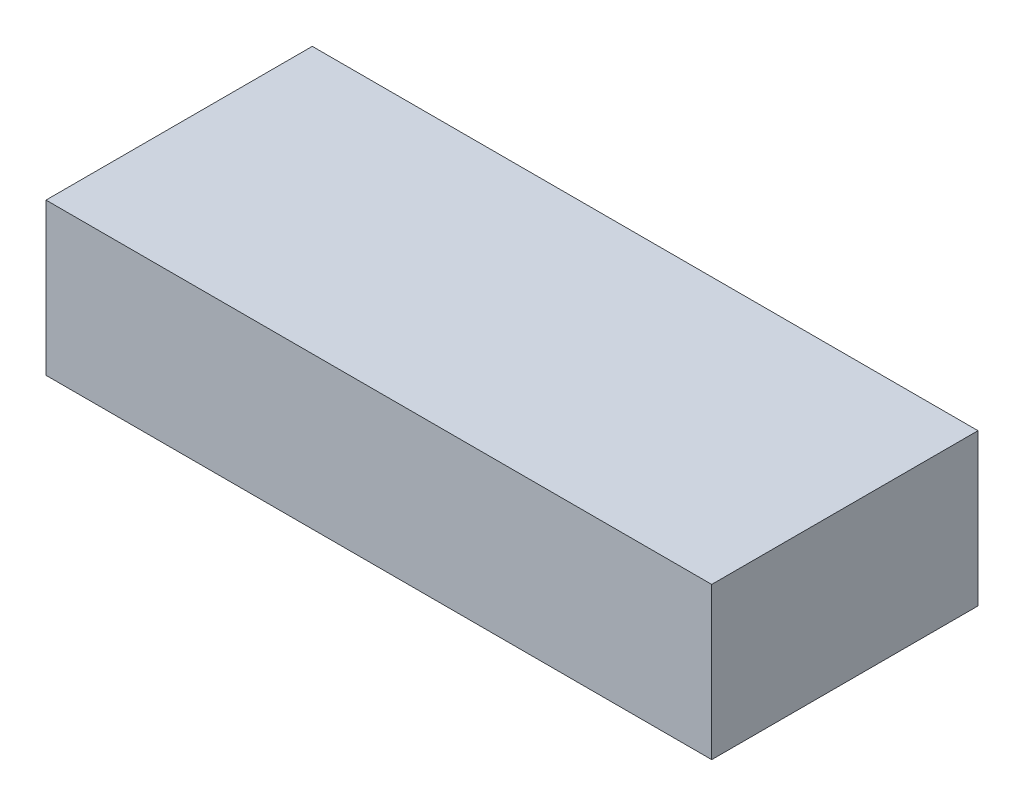
ISO-10303-21;
HEADER;
FILE_DESCRIPTION(('STEP AP214'),'2;1');
FILE_NAME('part.step','',(''),(''),'','','');
FILE_SCHEMA(('AUTOMOTIVE_DESIGN { 1 0 10303 214 1 1 1 1 }'));
ENDSEC;
DATA;
#1=APPLICATION_CONTEXT('core data for automotive mechanical design processes');
#2=APPLICATION_PROTOCOL_DEFINITION('international standard','automotive_design',2000,#1);
#3=PRODUCT_CONTEXT('',#1,'mechanical');
#4=PRODUCT('Part','Part','',(#3));
#5=PRODUCT_RELATED_PRODUCT_CATEGORY('part','',(#4));
#6=PRODUCT_DEFINITION_FORMATION('','',#4);
#7=PRODUCT_DEFINITION_CONTEXT('part definition',#1,'design');
#8=PRODUCT_DEFINITION('design','',#6,#7);
#9=PRODUCT_DEFINITION_SHAPE('','',#8);
#10=(LENGTH_UNIT() NAMED_UNIT(*) SI_UNIT(.MILLI.,.METRE.));
#11=(NAMED_UNIT(*) PLANE_ANGLE_UNIT() SI_UNIT($,.RADIAN.));
#12=(NAMED_UNIT(*) SI_UNIT($,.STERADIAN.) SOLID_ANGLE_UNIT());
#13=UNCERTAINTY_MEASURE_WITH_UNIT(LENGTH_MEASURE(1.E-05),#10,'distance_accuracy_value','');
#14=(GEOMETRIC_REPRESENTATION_CONTEXT(3) GLOBAL_UNCERTAINTY_ASSIGNED_CONTEXT((#13)) GLOBAL_UNIT_ASSIGNED_CONTEXT((#10,
#11,#12)) REPRESENTATION_CONTEXT('',''));
#15=CARTESIAN_POINT('',(0.,0.,0.));
#16=DIRECTION('',(0.,0.,1.));
#17=DIRECTION('',(1.,0.,0.));
#18=AXIS2_PLACEMENT_3D('',#15,#16,#17);
#19=CARTESIAN_POINT('',(12.5,5.7,-5.));
#20=DIRECTION('',(-1.,0.,0.));
#21=DIRECTION('',(0.,0.,1.));
#22=AXIS2_PLACEMENT_3D('',#19,#20,#21);
#23=PLANE('',#22);
#24=DIRECTION('',(0.,0.,-1.));
#25=VECTOR('',#24,1.);
#26=CARTESIAN_POINT('',(12.5,0.,-5.));
#27=LINE('',#26,#25);
#28=CARTESIAN_POINT('',(12.5,0.,5.));
#29=VERTEX_POINT('',#28);
#30=CARTESIAN_POINT('',(12.5,0.,-5.));
#31=VERTEX_POINT('',#30);
#32=EDGE_CURVE('E111',#29,#31,#27,.T.);
#33=ORIENTED_EDGE('',*,*,#32,.T.);
#34=DIRECTION('',(0.,-1.,0.));
#35=VECTOR('',#34,1.);
#36=CARTESIAN_POINT('',(12.5,5.7,-5.));
#37=LINE('',#36,#35);
#38=CARTESIAN_POINT('',(12.5,5.7,-5.));
#39=VERTEX_POINT('',#38);
#40=EDGE_CURVE('E11',#39,#31,#37,.T.);
#41=ORIENTED_EDGE('',*,*,#40,.F.);
#42=DIRECTION('',(0.,0.,-1.));
#43=VECTOR('',#42,1.);
#44=CARTESIAN_POINT('',(12.5,5.7,-5.));
#45=LINE('',#44,#43);
#46=CARTESIAN_POINT('',(12.5,5.7,5.));
#47=VERTEX_POINT('',#46);
#48=EDGE_CURVE('E95',#47,#39,#45,.T.);
#49=ORIENTED_EDGE('',*,*,#48,.F.);
#50=DIRECTION('',(0.,-1.,0.));
#51=VECTOR('',#50,1.);
#52=CARTESIAN_POINT('',(12.5,5.7,5.));
#53=LINE('',#52,#51);
#54=EDGE_CURVE('E107',#47,#29,#53,.T.);
#55=ORIENTED_EDGE('',*,*,#54,.T.);
#56=EDGE_LOOP('',(#33,#41,#49,#55));
#57=FACE_BOUND('',#56,.T.);
#58=ADVANCED_FACE('F43',(#57),#23,.F.);
#59=CARTESIAN_POINT('',(-12.5,5.7,-5.));
#60=DIRECTION('',(0.,0.,1.));
#61=DIRECTION('',(1.,0.,0.));
#62=AXIS2_PLACEMENT_3D('',#59,#60,#61);
#63=PLANE('',#62);
#64=DIRECTION('',(-1.,0.,0.));
#65=VECTOR('',#64,1.);
#66=CARTESIAN_POINT('',(-12.5,0.,-5.));
#67=LINE('',#66,#65);
#68=CARTESIAN_POINT('',(-12.5,0.,-5.));
#69=VERTEX_POINT('',#68);
#70=EDGE_CURVE('E100',#31,#69,#67,.T.);
#71=ORIENTED_EDGE('',*,*,#70,.T.);
#72=DIRECTION('',(0.,-1.,0.));
#73=VECTOR('',#72,1.);
#74=CARTESIAN_POINT('',(-12.5,5.7,-5.));
#75=LINE('',#74,#73);
#76=CARTESIAN_POINT('',(-12.5,5.7,-5.));
#77=VERTEX_POINT('',#76);
#78=EDGE_CURVE('E52',#77,#69,#75,.T.);
#79=ORIENTED_EDGE('',*,*,#78,.F.);
#80=DIRECTION('',(-1.,0.,0.));
#81=VECTOR('',#80,1.);
#82=CARTESIAN_POINT('',(-12.5,5.7,-5.));
#83=LINE('',#82,#81);
#84=EDGE_CURVE('E90',#39,#77,#83,.T.);
#85=ORIENTED_EDGE('',*,*,#84,.F.);
#86=ORIENTED_EDGE('',*,*,#40,.T.);
#87=EDGE_LOOP('',(#71,#79,#85,#86));
#88=FACE_BOUND('',#87,.T.);
#89=ADVANCED_FACE('F99',(#88),#63,.F.);
#90=CARTESIAN_POINT('',(-12.5,5.7,-5.));
#91=DIRECTION('',(1.,0.,0.));
#92=DIRECTION('',(0.,0.,-1.));
#93=AXIS2_PLACEMENT_3D('',#90,#91,#92);
#94=PLANE('',#93);
#95=DIRECTION('',(0.,0.,1.));
#96=VECTOR('',#95,1.);
#97=CARTESIAN_POINT('',(-12.5,0.,-5.));
#98=LINE('',#97,#96);
#99=CARTESIAN_POINT('',(-12.5,0.,5.));
#100=VERTEX_POINT('',#99);
#101=EDGE_CURVE('E77',#69,#100,#98,.T.);
#102=ORIENTED_EDGE('',*,*,#101,.T.);
#103=DIRECTION('',(0.,-1.,0.));
#104=VECTOR('',#103,1.);
#105=CARTESIAN_POINT('',(-12.5,5.7,5.));
#106=LINE('',#105,#104);
#107=CARTESIAN_POINT('',(-12.5,5.7,5.));
#108=VERTEX_POINT('',#107);
#109=EDGE_CURVE('E102',#108,#100,#106,.T.);
#110=ORIENTED_EDGE('',*,*,#109,.F.);
#111=DIRECTION('',(0.,0.,1.));
#112=VECTOR('',#111,1.);
#113=CARTESIAN_POINT('',(-12.5,5.7,-5.));
#114=LINE('',#113,#112);
#115=EDGE_CURVE('E93',#77,#108,#114,.T.);
#116=ORIENTED_EDGE('',*,*,#115,.F.);
#117=ORIENTED_EDGE('',*,*,#78,.T.);
#118=EDGE_LOOP('',(#102,#110,#116,#117));
#119=FACE_BOUND('',#118,.T.);
#120=ADVANCED_FACE('F103',(#119),#94,.F.);
#121=CARTESIAN_POINT('',(-12.5,5.7,5.));
#122=DIRECTION('',(0.,0.,-1.));
#123=DIRECTION('',(-1.,0.,0.));
#124=AXIS2_PLACEMENT_3D('',#121,#122,#123);
#125=PLANE('',#124);
#126=DIRECTION('',(1.,0.,0.));
#127=VECTOR('',#126,1.);
#128=CARTESIAN_POINT('',(-12.5,0.,5.));
#129=LINE('',#128,#127);
#130=EDGE_CURVE('E83',#100,#29,#129,.T.);
#131=ORIENTED_EDGE('',*,*,#130,.T.);
#132=ORIENTED_EDGE('',*,*,#54,.F.);
#133=DIRECTION('',(1.,0.,0.));
#134=VECTOR('',#133,1.);
#135=CARTESIAN_POINT('',(-12.5,5.7,5.));
#136=LINE('',#135,#134);
#137=EDGE_CURVE('E60',#108,#47,#136,.T.);
#138=ORIENTED_EDGE('',*,*,#137,.F.);
#139=ORIENTED_EDGE('',*,*,#109,.T.);
#140=EDGE_LOOP('',(#131,#132,#138,#139));
#141=FACE_BOUND('',#140,.T.);
#142=ADVANCED_FACE('F124',(#141),#125,.F.);
#143=CARTESIAN_POINT('',(0.,5.7,0.));
#144=DIRECTION('',(0.,1.,0.));
#145=DIRECTION('',(0.,0.,1.));
#146=AXIS2_PLACEMENT_3D('',#143,#144,#145);
#147=PLANE('',#146);
#148=ORIENTED_EDGE('',*,*,#48,.T.);
#149=ORIENTED_EDGE('',*,*,#84,.T.);
#150=ORIENTED_EDGE('',*,*,#115,.T.);
#151=ORIENTED_EDGE('',*,*,#137,.T.);
#152=EDGE_LOOP('',(#148,#149,#150,#151));
#153=FACE_BOUND('',#152,.T.);
#154=ADVANCED_FACE('F91',(#153),#147,.T.);
#155=CARTESIAN_POINT('',(0.,0.,0.));
#156=DIRECTION('',(0.,1.,0.));
#157=DIRECTION('',(0.,0.,1.));
#158=AXIS2_PLACEMENT_3D('',#155,#156,#157);
#159=PLANE('',#158);
#160=ORIENTED_EDGE('',*,*,#32,.F.);
#161=ORIENTED_EDGE('',*,*,#130,.F.);
#162=ORIENTED_EDGE('',*,*,#101,.F.);
#163=ORIENTED_EDGE('',*,*,#70,.F.);
#164=EDGE_LOOP('',(#160,#161,#162,#163));
#165=FACE_BOUND('',#164,.T.);
#166=ADVANCED_FACE('F127',(#165),#159,.F.);
#167=CLOSED_SHELL('',(#58,#89,#120,#142,#154,#166));
#168=MANIFOLD_SOLID_BREP('B2',#167);
#169=ADVANCED_BREP_SHAPE_REPRESENTATION('',(#18,#168),#14);
#170=SHAPE_DEFINITION_REPRESENTATION(#9,#169);
ENDSEC;
END-ISO-10303-21;
